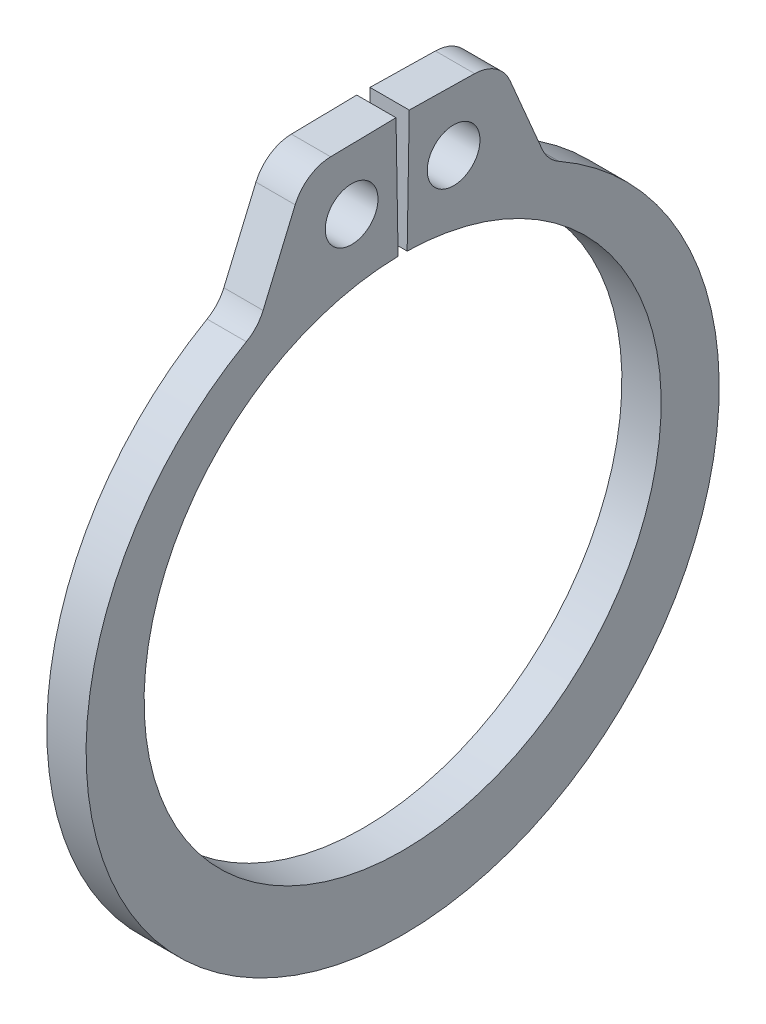
ISO-10303-21;
HEADER;
FILE_DESCRIPTION(('STEP AP214'),'2;1');
FILE_NAME('part.step','',(''),(''),'','','');
FILE_SCHEMA(('AUTOMOTIVE_DESIGN { 1 0 10303 214 1 1 1 1 }'));
ENDSEC;
DATA;
#1=APPLICATION_CONTEXT('core data for automotive mechanical design processes');
#2=APPLICATION_PROTOCOL_DEFINITION('international standard','automotive_design',2000,#1);
#3=PRODUCT_CONTEXT('',#1,'mechanical');
#4=PRODUCT('Part','Part','',(#3));
#5=PRODUCT_RELATED_PRODUCT_CATEGORY('part','',(#4));
#6=PRODUCT_DEFINITION_FORMATION('','',#4);
#7=PRODUCT_DEFINITION_CONTEXT('part definition',#1,'design');
#8=PRODUCT_DEFINITION('design','',#6,#7);
#9=PRODUCT_DEFINITION_SHAPE('','',#8);
#10=(LENGTH_UNIT() NAMED_UNIT(*) SI_UNIT(.MILLI.,.METRE.));
#11=(NAMED_UNIT(*) PLANE_ANGLE_UNIT() SI_UNIT($,.RADIAN.));
#12=(NAMED_UNIT(*) SI_UNIT($,.STERADIAN.) SOLID_ANGLE_UNIT());
#13=UNCERTAINTY_MEASURE_WITH_UNIT(LENGTH_MEASURE(1.E-05),#10,'distance_accuracy_value','');
#14=(GEOMETRIC_REPRESENTATION_CONTEXT(3) GLOBAL_UNCERTAINTY_ASSIGNED_CONTEXT((#13)) GLOBAL_UNIT_ASSIGNED_CONTEXT((#10,
#11,#12)) REPRESENTATION_CONTEXT('',''));
#15=CARTESIAN_POINT('',(0.,0.,0.));
#16=DIRECTION('',(0.,0.,1.));
#17=DIRECTION('',(1.,0.,0.));
#18=AXIS2_PLACEMENT_3D('',#15,#16,#17);
#19=CARTESIAN_POINT('',(0.4445,0.,0.));
#20=DIRECTION('',(1.,0.,0.));
#21=DIRECTION('',(0.,0.,-1.));
#22=AXIS2_PLACEMENT_3D('',#19,#20,#21);
#23=PLANE('',#22);
#24=CARTESIAN_POINT('',(0.4445,7.20724610900659,-1.15465964864512));
#25=DIRECTION('',(-1.,0.,0.));
#26=DIRECTION('',(0.,0.,1.));
#27=AXIS2_PLACEMENT_3D('',#24,#25,#26);
#28=CIRCLE('',#27,0.5969);
#29=CARTESIAN_POINT('',(0.4445,7.20724610900659,-0.557759648645121));
#30=VERTEX_POINT('',#29);
#31=EDGE_CURVE('E108',#30,#30,#28,.T.);
#32=ORIENTED_EDGE('',*,*,#31,.T.);
#33=EDGE_LOOP('',(#32));
#34=FACE_BOUND('',#33,.T.);
#35=CARTESIAN_POINT('',(0.4445,0.,0.));
#36=DIRECTION('',(-1.,0.,0.));
#37=DIRECTION('',(0.,0.,1.));
#38=AXIS2_PLACEMENT_3D('',#35,#36,#37);
#39=CIRCLE('',#38,5.8547);
#40=CARTESIAN_POINT('',(0.4445,5.85380830083212,-0.102178603968365));
#41=VERTEX_POINT('',#40);
#42=CARTESIAN_POINT('',(0.4445,5.85380830083212,0.102178603968364));
#43=VERTEX_POINT('',#42);
#44=EDGE_CURVE('E174',#41,#43,#39,.T.);
#45=ORIENTED_EDGE('',*,*,#44,.T.);
#46=DIRECTION('',(0.,-0.999847695156391,-0.0174524064372836));
#47=VECTOR('',#46,1.);
#48=CARTESIAN_POINT('',(0.4445,5.85380830083212,0.102178603968364));
#49=LINE('',#48,#47);
#50=CARTESIAN_POINT('',(0.4445,8.59659049818514,0.150054045307121));
#51=VERTEX_POINT('',#50);
#52=EDGE_CURVE('E124',#43,#51,#49,.F.);
#53=ORIENTED_EDGE('',*,*,#52,.T.);
#54=DIRECTION('',(0.,0.0174524064372841,-0.999847695156391));
#55=VECTOR('',#54,1.);
#56=CARTESIAN_POINT('',(0.4445,8.59659049818514,0.150054045307121));
#57=LINE('',#56,#55);
#58=CARTESIAN_POINT('',(0.4445,8.57074959100772,1.63047862600547));
#59=VERTEX_POINT('',#58);
#60=EDGE_CURVE('E119',#51,#59,#57,.F.);
#61=ORIENTED_EDGE('',*,*,#60,.T.);
#62=CARTESIAN_POINT('',(0.4445,7.68188499001369,1.61496343668273));
#63=DIRECTION('',(-1.,0.,0.));
#64=DIRECTION('',(0.,0.,1.));
#65=AXIS2_PLACEMENT_3D('',#62,#63,#64);
#66=CIRCLE('',#65,0.889);
#67=CARTESIAN_POINT('',(0.4445,8.02998759243226,2.43297662617873));
#68=VERTEX_POINT('',#67);
#69=EDGE_CURVE('E112',#68,#59,#66,.T.);
#70=ORIENTED_EDGE('',*,*,#69,.F.);
#71=DIRECTION('',(0.,0.920149819455567,-0.391566481910655));
#72=VECTOR('',#71,1.);
#73=CARTESIAN_POINT('',(0.4445,8.56068391718107,2.20714069332188));
#74=LINE('',#73,#72);
#75=CARTESIAN_POINT('',(0.4445,6.32221463110736,3.15971333386378));
#76=VERTEX_POINT('',#75);
#77=EDGE_CURVE('E107',#68,#76,#74,.F.);
#78=ORIENTED_EDGE('',*,*,#77,.T.);
#79=CARTESIAN_POINT('',(0.4445,6.67031723352593,3.97772652335978));
#80=DIRECTION('',(-1.,0.,0.));
#81=DIRECTION('',(0.,0.,1.));
#82=AXIS2_PLACEMENT_3D('',#79,#80,#81);
#83=CIRCLE('',#82,0.889);
#84=CARTESIAN_POINT('',(0.4445,5.89719335877508,3.53886381784672));
#85=VERTEX_POINT('',#84);
#86=EDGE_CURVE('E98',#76,#85,#83,.T.);
#87=ORIENTED_EDGE('',*,*,#86,.T.);
#88=CARTESIAN_POINT('',(0.4445,-0.337057291142251,0.));
#89=DIRECTION('',(-1.,0.,0.));
#90=DIRECTION('',(0.,0.,1.));
#91=AXIS2_PLACEMENT_3D('',#88,#89,#90);
#92=CIRCLE('',#91,7.16864270885775);
#93=CARTESIAN_POINT('',(0.4445,5.89719335877508,-3.53886381784672));
#94=VERTEX_POINT('',#93);
#95=EDGE_CURVE('E181',#94,#85,#92,.T.);
#96=ORIENTED_EDGE('',*,*,#95,.F.);
#97=CARTESIAN_POINT('',(0.4445,6.67031723352593,-3.97772652335978));
#98=DIRECTION('',(-1.,0.,0.));
#99=DIRECTION('',(0.,0.,1.));
#100=AXIS2_PLACEMENT_3D('',#97,#98,#99);
#101=CIRCLE('',#100,0.889);
#102=CARTESIAN_POINT('',(0.4445,6.32221463110736,-3.15971333386378));
#103=VERTEX_POINT('',#102);
#104=EDGE_CURVE('E178',#94,#103,#101,.T.);
#105=ORIENTED_EDGE('',*,*,#104,.T.);
#106=DIRECTION('',(0.,-0.920149819455567,-0.391566481910655));
#107=VECTOR('',#106,1.);
#108=CARTESIAN_POINT('',(0.4445,8.56068391718107,-2.20714069332188));
#109=LINE('',#108,#107);
#110=CARTESIAN_POINT('',(0.4445,8.02998759243226,-2.43297662617873));
#111=VERTEX_POINT('',#110);
#112=EDGE_CURVE('E143',#103,#111,#109,.F.);
#113=ORIENTED_EDGE('',*,*,#112,.T.);
#114=CARTESIAN_POINT('',(0.4445,7.68188499001369,-1.61496343668273));
#115=DIRECTION('',(-1.,0.,0.));
#116=DIRECTION('',(0.,0.,1.));
#117=AXIS2_PLACEMENT_3D('',#114,#115,#116);
#118=CIRCLE('',#117,0.889);
#119=CARTESIAN_POINT('',(0.4445,8.57074959100772,-1.63047862600547));
#120=VERTEX_POINT('',#119);
#121=EDGE_CURVE('E145',#120,#111,#118,.T.);
#122=ORIENTED_EDGE('',*,*,#121,.F.);
#123=DIRECTION('',(0.,-0.0174524064372841,-0.999847695156391));
#124=VECTOR('',#123,1.);
#125=CARTESIAN_POINT('',(0.4445,8.59659049818514,-0.150054045307121));
#126=LINE('',#125,#124);
#127=CARTESIAN_POINT('',(0.4445,8.59659049818514,-0.150054045307121));
#128=VERTEX_POINT('',#127);
#129=EDGE_CURVE('E137',#120,#128,#126,.F.);
#130=ORIENTED_EDGE('',*,*,#129,.T.);
#131=DIRECTION('',(0.,0.999847695156391,-0.0174524064372836));
#132=VECTOR('',#131,1.);
#133=CARTESIAN_POINT('',(0.4445,5.85380830083212,-0.102178603968364));
#134=LINE('',#133,#132);
#135=EDGE_CURVE('E130',#128,#41,#134,.F.);
#136=ORIENTED_EDGE('',*,*,#135,.T.);
#137=EDGE_LOOP('',(#45,#53,#61,#70,#78,#87,#96,#105,#113,#122,#130,#136));
#138=FACE_BOUND('',#137,.T.);
#139=CARTESIAN_POINT('',(0.4445,7.20724610900659,1.15465964864512));
#140=DIRECTION('',(-1.,0.,0.));
#141=DIRECTION('',(0.,0.,1.));
#142=AXIS2_PLACEMENT_3D('',#139,#140,#141);
#143=CIRCLE('',#142,0.5969);
#144=CARTESIAN_POINT('',(0.4445,7.20724610900659,1.75155964864512));
#145=VERTEX_POINT('',#144);
#146=EDGE_CURVE('E20',#145,#145,#143,.T.);
#147=ORIENTED_EDGE('',*,*,#146,.T.);
#148=EDGE_LOOP('',(#147));
#149=FACE_BOUND('',#148,.T.);
#150=ADVANCED_FACE('F17',(#34,#138,#149),#23,.T.);
#151=CARTESIAN_POINT('',(0.4445,7.20724610900659,1.15465964864512));
#152=DIRECTION('',(-1.,0.,0.));
#153=DIRECTION('',(0.,0.,1.));
#154=AXIS2_PLACEMENT_3D('',#151,#152,#153);
#155=CYLINDRICAL_SURFACE('',#154,0.5969);
#156=CARTESIAN_POINT('',(-0.4445,7.20724610900659,1.15465964864512));
#157=DIRECTION('',(-1.,0.,0.));
#158=DIRECTION('',(0.,0.,1.));
#159=AXIS2_PLACEMENT_3D('',#156,#157,#158);
#160=CIRCLE('',#159,0.5969);
#161=CARTESIAN_POINT('',(-0.4445,7.20724610900659,1.75155964864512));
#162=VERTEX_POINT('',#161);
#163=EDGE_CURVE('E168',#162,#162,#160,.T.);
#164=ORIENTED_EDGE('',*,*,#163,.T.);
#165=EDGE_LOOP('',(#164));
#166=FACE_BOUND('',#165,.T.);
#167=ORIENTED_EDGE('',*,*,#146,.F.);
#168=EDGE_LOOP('',(#167));
#169=FACE_BOUND('',#168,.T.);
#170=ADVANCED_FACE('F388',(#166,#169),#155,.F.);
#171=CARTESIAN_POINT('',(0.4445,6.67031723352593,3.97772652335978));
#172=DIRECTION('',(-1.,0.,0.));
#173=DIRECTION('',(0.,0.,1.));
#174=AXIS2_PLACEMENT_3D('',#171,#172,#173);
#175=CYLINDRICAL_SURFACE('',#174,0.889);
#176=DIRECTION('',(1.,0.,0.));
#177=VECTOR('',#176,1.);
#178=CARTESIAN_POINT('',(0.4445,6.32221463110736,3.15971333386378));
#179=LINE('',#178,#177);
#180=CARTESIAN_POINT('',(-0.4445,6.32221463110736,3.15971333386378));
#181=VERTEX_POINT('',#180);
#182=EDGE_CURVE('E102',#76,#181,#179,.F.);
#183=ORIENTED_EDGE('',*,*,#182,.T.);
#184=CARTESIAN_POINT('',(-0.4445,6.67031723352593,3.97772652335978));
#185=DIRECTION('',(-1.,0.,0.));
#186=DIRECTION('',(0.,0.,1.));
#187=AXIS2_PLACEMENT_3D('',#184,#185,#186);
#188=CIRCLE('',#187,0.889);
#189=CARTESIAN_POINT('',(-0.4445,5.89719335877508,3.53886381784672));
#190=VERTEX_POINT('',#189);
#191=EDGE_CURVE('E166',#181,#190,#188,.T.);
#192=ORIENTED_EDGE('',*,*,#191,.T.);
#193=DIRECTION('',(-1.,0.,0.));
#194=VECTOR('',#193,1.);
#195=CARTESIAN_POINT('',(0.4445,5.89719335877508,3.53886381784672));
#196=LINE('',#195,#194);
#197=EDGE_CURVE('E103',#85,#190,#196,.T.);
#198=ORIENTED_EDGE('',*,*,#197,.F.);
#199=ORIENTED_EDGE('',*,*,#86,.F.);
#200=EDGE_LOOP('',(#183,#192,#198,#199));
#201=FACE_BOUND('',#200,.T.);
#202=ADVANCED_FACE('F100',(#201),#175,.F.);
#203=CARTESIAN_POINT('',(0.4445,-0.337057291142251,0.));
#204=DIRECTION('',(-1.,0.,0.));
#205=DIRECTION('',(0.,0.,1.));
#206=AXIS2_PLACEMENT_3D('',#203,#204,#205);
#207=CYLINDRICAL_SURFACE('',#206,7.16864270885775);
#208=CARTESIAN_POINT('',(-0.4445,-0.337057291142251,0.));
#209=DIRECTION('',(-1.,0.,0.));
#210=DIRECTION('',(0.,0.,1.));
#211=AXIS2_PLACEMENT_3D('',#208,#209,#210);
#212=CIRCLE('',#211,7.16864270885775);
#213=CARTESIAN_POINT('',(-0.4445,5.89719335877508,-3.53886381784672));
#214=VERTEX_POINT('',#213);
#215=EDGE_CURVE('E164',#190,#214,#212,.F.);
#216=ORIENTED_EDGE('',*,*,#215,.T.);
#217=DIRECTION('',(-1.,0.,0.));
#218=VECTOR('',#217,1.);
#219=CARTESIAN_POINT('',(0.4445,5.89719335877508,-3.53886381784672));
#220=LINE('',#219,#218);
#221=EDGE_CURVE('E180',#214,#94,#220,.F.);
#222=ORIENTED_EDGE('',*,*,#221,.T.);
#223=ORIENTED_EDGE('',*,*,#95,.T.);
#224=ORIENTED_EDGE('',*,*,#197,.T.);
#225=EDGE_LOOP('',(#216,#222,#223,#224));
#226=FACE_BOUND('',#225,.T.);
#227=ADVANCED_FACE('F186',(#226),#207,.T.);
#228=CARTESIAN_POINT('',(0.4445,6.67031723352593,-3.97772652335978));
#229=DIRECTION('',(-1.,0.,0.));
#230=DIRECTION('',(0.,0.,1.));
#231=AXIS2_PLACEMENT_3D('',#228,#229,#230);
#232=CYLINDRICAL_SURFACE('',#231,0.889);
#233=ORIENTED_EDGE('',*,*,#221,.F.);
#234=CARTESIAN_POINT('',(-0.4445,6.67031723352593,-3.97772652335978));
#235=DIRECTION('',(-1.,0.,0.));
#236=DIRECTION('',(0.,0.,1.));
#237=AXIS2_PLACEMENT_3D('',#234,#235,#236);
#238=CIRCLE('',#237,0.889);
#239=CARTESIAN_POINT('',(-0.4445,6.32221463110736,-3.15971333386378));
#240=VERTEX_POINT('',#239);
#241=EDGE_CURVE('E161',#214,#240,#238,.T.);
#242=ORIENTED_EDGE('',*,*,#241,.T.);
#243=DIRECTION('',(1.,0.,0.));
#244=VECTOR('',#243,1.);
#245=CARTESIAN_POINT('',(0.4445,6.32221463110736,-3.15971333386378));
#246=LINE('',#245,#244);
#247=EDGE_CURVE('E146',#240,#103,#246,.T.);
#248=ORIENTED_EDGE('',*,*,#247,.T.);
#249=ORIENTED_EDGE('',*,*,#104,.F.);
#250=EDGE_LOOP('',(#233,#242,#248,#249));
#251=FACE_BOUND('',#250,.T.);
#252=ADVANCED_FACE('F198',(#251),#232,.F.);
#253=CARTESIAN_POINT('',(0.4445,8.56068391718107,-2.20714069332188));
#254=DIRECTION('',(0.,-0.391566481910655,0.920149819455567));
#255=DIRECTION('',(0.,-0.920149819455567,-0.391566481910655));
#256=AXIS2_PLACEMENT_3D('',#253,#254,#255);
#257=PLANE('',#256);
#258=ORIENTED_EDGE('',*,*,#247,.F.);
#259=DIRECTION('',(0.,0.920149819455567,0.391566481910655));
#260=VECTOR('',#259,1.);
#261=CARTESIAN_POINT('',(-0.4445,6.32221463110736,-3.15971333386378));
#262=LINE('',#261,#260);
#263=CARTESIAN_POINT('',(-0.4445,8.02998759243226,-2.43297662617873));
#264=VERTEX_POINT('',#263);
#265=EDGE_CURVE('E160',#240,#264,#262,.T.);
#266=ORIENTED_EDGE('',*,*,#265,.T.);
#267=DIRECTION('',(-1.,0.,0.));
#268=VECTOR('',#267,1.);
#269=CARTESIAN_POINT('',(0.4445,8.02998759243226,-2.43297662617873));
#270=LINE('',#269,#268);
#271=EDGE_CURVE('E177',#111,#264,#270,.T.);
#272=ORIENTED_EDGE('',*,*,#271,.F.);
#273=ORIENTED_EDGE('',*,*,#112,.F.);
#274=EDGE_LOOP('',(#258,#266,#272,#273));
#275=FACE_BOUND('',#274,.T.);
#276=ADVANCED_FACE('F203',(#275),#257,.F.);
#277=CARTESIAN_POINT('',(0.4445,7.68188499001369,-1.61496343668273));
#278=DIRECTION('',(-1.,0.,0.));
#279=DIRECTION('',(0.,0.,1.));
#280=AXIS2_PLACEMENT_3D('',#277,#278,#279);
#281=CYLINDRICAL_SURFACE('',#280,0.889);
#282=CARTESIAN_POINT('',(-0.4445,7.68188499001369,-1.61496343668273));
#283=DIRECTION('',(-1.,0.,0.));
#284=DIRECTION('',(0.,0.,1.));
#285=AXIS2_PLACEMENT_3D('',#282,#283,#284);
#286=CIRCLE('',#285,0.889);
#287=CARTESIAN_POINT('',(-0.4445,8.57074959100772,-1.63047862600547));
#288=VERTEX_POINT('',#287);
#289=EDGE_CURVE('E156',#264,#288,#286,.F.);
#290=ORIENTED_EDGE('',*,*,#289,.T.);
#291=DIRECTION('',(1.,0.,0.));
#292=VECTOR('',#291,1.);
#293=CARTESIAN_POINT('',(0.4445,8.57074959100772,-1.63047862600547));
#294=LINE('',#293,#292);
#295=EDGE_CURVE('E140',#288,#120,#294,.T.);
#296=ORIENTED_EDGE('',*,*,#295,.T.);
#297=ORIENTED_EDGE('',*,*,#121,.T.);
#298=ORIENTED_EDGE('',*,*,#271,.T.);
#299=EDGE_LOOP('',(#290,#296,#297,#298));
#300=FACE_BOUND('',#299,.T.);
#301=ADVANCED_FACE('F266',(#300),#281,.T.);
#302=CARTESIAN_POINT('',(0.4445,8.59659049818514,-0.150054045307121));
#303=DIRECTION('',(0.,-0.999847695156391,0.0174524064372841));
#304=DIRECTION('',(0.,-0.0174524064372841,-0.999847695156391));
#305=AXIS2_PLACEMENT_3D('',#302,#303,#304);
#306=PLANE('',#305);
#307=ORIENTED_EDGE('',*,*,#295,.F.);
#308=DIRECTION('',(0.,0.0174524064372836,0.999847695156391));
#309=VECTOR('',#308,1.);
#310=CARTESIAN_POINT('',(-0.4445,8.57074959100772,-1.63047862600547));
#311=LINE('',#310,#309);
#312=CARTESIAN_POINT('',(-0.4445,8.59659049818514,-0.150054045307121));
#313=VERTEX_POINT('',#312);
#314=EDGE_CURVE('E159',#288,#313,#311,.T.);
#315=ORIENTED_EDGE('',*,*,#314,.T.);
#316=DIRECTION('',(1.,0.,0.));
#317=VECTOR('',#316,1.);
#318=CARTESIAN_POINT('',(0.4445,8.59659049818514,-0.150054045307121));
#319=LINE('',#318,#317);
#320=EDGE_CURVE('E134',#313,#128,#319,.T.);
#321=ORIENTED_EDGE('',*,*,#320,.T.);
#322=ORIENTED_EDGE('',*,*,#129,.F.);
#323=EDGE_LOOP('',(#307,#315,#321,#322));
#324=FACE_BOUND('',#323,.T.);
#325=ADVANCED_FACE('F264',(#324),#306,.F.);
#326=CARTESIAN_POINT('',(0.4445,5.85380830083212,-0.102178603968364));
#327=DIRECTION('',(0.,-0.0174524064372836,-0.999847695156391));
#328=DIRECTION('',(0.,0.999847695156391,-0.0174524064372836));
#329=AXIS2_PLACEMENT_3D('',#326,#327,#328);
#330=PLANE('',#329);
#331=DIRECTION('',(-1.,0.,0.));
#332=VECTOR('',#331,1.);
#333=CARTESIAN_POINT('',(0.4445,5.85380830083212,-0.102178603968365));
#334=LINE('',#333,#332);
#335=CARTESIAN_POINT('',(-0.4445,5.85380830083212,-0.102178603968365));
#336=VERTEX_POINT('',#335);
#337=EDGE_CURVE('E133',#336,#41,#334,.F.);
#338=ORIENTED_EDGE('',*,*,#337,.T.);
#339=ORIENTED_EDGE('',*,*,#135,.F.);
#340=ORIENTED_EDGE('',*,*,#320,.F.);
#341=DIRECTION('',(0.,-0.999847695156391,0.0174524064372836));
#342=VECTOR('',#341,1.);
#343=CARTESIAN_POINT('',(-0.4445,8.59659049818514,-0.150054045307121));
#344=LINE('',#343,#342);
#345=EDGE_CURVE('E155',#313,#336,#344,.T.);
#346=ORIENTED_EDGE('',*,*,#345,.T.);
#347=EDGE_LOOP('',(#338,#339,#340,#346));
#348=FACE_BOUND('',#347,.T.);
#349=ADVANCED_FACE('F259',(#348),#330,.F.);
#350=CARTESIAN_POINT('',(0.4445,0.,0.));
#351=DIRECTION('',(-1.,0.,0.));
#352=DIRECTION('',(0.,0.,1.));
#353=AXIS2_PLACEMENT_3D('',#350,#351,#352);
#354=CYLINDRICAL_SURFACE('',#353,5.8547);
#355=ORIENTED_EDGE('',*,*,#44,.F.);
#356=ORIENTED_EDGE('',*,*,#337,.F.);
#357=CARTESIAN_POINT('',(-0.4445,0.,0.));
#358=DIRECTION('',(-1.,0.,0.));
#359=DIRECTION('',(0.,0.,1.));
#360=AXIS2_PLACEMENT_3D('',#357,#358,#359);
#361=CIRCLE('',#360,5.8547);
#362=CARTESIAN_POINT('',(-0.4445,5.85380830083212,0.102178603968364));
#363=VERTEX_POINT('',#362);
#364=EDGE_CURVE('E152',#336,#363,#361,.T.);
#365=ORIENTED_EDGE('',*,*,#364,.T.);
#366=DIRECTION('',(1.,0.,0.));
#367=VECTOR('',#366,1.);
#368=CARTESIAN_POINT('',(0.4445,5.85380830083212,0.102178603968364));
#369=LINE('',#368,#367);
#370=EDGE_CURVE('E127',#363,#43,#369,.T.);
#371=ORIENTED_EDGE('',*,*,#370,.T.);
#372=EDGE_LOOP('',(#355,#356,#365,#371));
#373=FACE_BOUND('',#372,.T.);
#374=ADVANCED_FACE('F254',(#373),#354,.F.);
#375=CARTESIAN_POINT('',(0.4445,5.85380830083212,0.102178603968364));
#376=DIRECTION('',(0.,-0.0174524064372836,0.999847695156391));
#377=DIRECTION('',(0.,-0.999847695156391,-0.0174524064372836));
#378=AXIS2_PLACEMENT_3D('',#375,#376,#377);
#379=PLANE('',#378);
#380=DIRECTION('',(1.,0.,0.));
#381=VECTOR('',#380,1.);
#382=CARTESIAN_POINT('',(0.4445,8.59659049818514,0.150054045307121));
#383=LINE('',#382,#381);
#384=CARTESIAN_POINT('',(-0.4445,8.59659049818514,0.150054045307121));
#385=VERTEX_POINT('',#384);
#386=EDGE_CURVE('E121',#385,#51,#383,.T.);
#387=ORIENTED_EDGE('',*,*,#386,.T.);
#388=ORIENTED_EDGE('',*,*,#52,.F.);
#389=ORIENTED_EDGE('',*,*,#370,.F.);
#390=DIRECTION('',(0.,0.999847695156391,0.0174524064372836));
#391=VECTOR('',#390,1.);
#392=CARTESIAN_POINT('',(-0.4445,5.85380830083212,0.102178603968364));
#393=LINE('',#392,#391);
#394=EDGE_CURVE('E154',#363,#385,#393,.T.);
#395=ORIENTED_EDGE('',*,*,#394,.T.);
#396=EDGE_LOOP('',(#387,#388,#389,#395));
#397=FACE_BOUND('',#396,.T.);
#398=ADVANCED_FACE('F251',(#397),#379,.F.);
#399=CARTESIAN_POINT('',(0.4445,8.59659049818514,0.150054045307121));
#400=DIRECTION('',(0.,-0.999847695156391,-0.0174524064372841));
#401=DIRECTION('',(0.,0.0174524064372841,-0.999847695156391));
#402=AXIS2_PLACEMENT_3D('',#399,#400,#401);
#403=PLANE('',#402);
#404=DIRECTION('',(-1.,0.,0.));
#405=VECTOR('',#404,1.);
#406=CARTESIAN_POINT('',(0.4445,8.57074959100772,1.63047862600547));
#407=LINE('',#406,#405);
#408=CARTESIAN_POINT('',(-0.4445,8.57074959100772,1.63047862600547));
#409=VERTEX_POINT('',#408);
#410=EDGE_CURVE('E114',#59,#409,#407,.T.);
#411=ORIENTED_EDGE('',*,*,#410,.F.);
#412=ORIENTED_EDGE('',*,*,#60,.F.);
#413=ORIENTED_EDGE('',*,*,#386,.F.);
#414=DIRECTION('',(0.,-0.0174524064372836,0.999847695156391));
#415=VECTOR('',#414,1.);
#416=CARTESIAN_POINT('',(-0.4445,8.59659049818514,0.150054045307121));
#417=LINE('',#416,#415);
#418=EDGE_CURVE('E151',#385,#409,#417,.T.);
#419=ORIENTED_EDGE('',*,*,#418,.T.);
#420=EDGE_LOOP('',(#411,#412,#413,#419));
#421=FACE_BOUND('',#420,.T.);
#422=ADVANCED_FACE('F244',(#421),#403,.F.);
#423=CARTESIAN_POINT('',(0.4445,7.68188499001369,1.61496343668273));
#424=DIRECTION('',(-1.,0.,0.));
#425=DIRECTION('',(0.,0.,1.));
#426=AXIS2_PLACEMENT_3D('',#423,#424,#425);
#427=CYLINDRICAL_SURFACE('',#426,0.889);
#428=CARTESIAN_POINT('',(-0.4445,7.68188499001369,1.61496343668273));
#429=DIRECTION('',(-1.,0.,0.));
#430=DIRECTION('',(0.,0.,1.));
#431=AXIS2_PLACEMENT_3D('',#428,#429,#430);
#432=CIRCLE('',#431,0.889);
#433=CARTESIAN_POINT('',(-0.4445,8.02998759243226,2.43297662617873));
#434=VERTEX_POINT('',#433);
#435=EDGE_CURVE('E148',#409,#434,#432,.F.);
#436=ORIENTED_EDGE('',*,*,#435,.T.);
#437=DIRECTION('',(1.,0.,0.));
#438=VECTOR('',#437,1.);
#439=CARTESIAN_POINT('',(0.4445,8.02998759243226,2.43297662617873));
#440=LINE('',#439,#438);
#441=EDGE_CURVE('E35',#434,#68,#440,.T.);
#442=ORIENTED_EDGE('',*,*,#441,.T.);
#443=ORIENTED_EDGE('',*,*,#69,.T.);
#444=ORIENTED_EDGE('',*,*,#410,.T.);
#445=EDGE_LOOP('',(#436,#442,#443,#444));
#446=FACE_BOUND('',#445,.T.);
#447=ADVANCED_FACE('F289',(#446),#427,.T.);
#448=CARTESIAN_POINT('',(0.4445,8.56068391718107,2.20714069332188));
#449=DIRECTION('',(0.,-0.391566481910655,-0.920149819455567));
#450=DIRECTION('',(0.,0.920149819455567,-0.391566481910655));
#451=AXIS2_PLACEMENT_3D('',#448,#449,#450);
#452=PLANE('',#451);
#453=ORIENTED_EDGE('',*,*,#182,.F.);
#454=ORIENTED_EDGE('',*,*,#77,.F.);
#455=ORIENTED_EDGE('',*,*,#441,.F.);
#456=DIRECTION('',(0.,-0.920149819455567,0.391566481910655));
#457=VECTOR('',#456,1.);
#458=CARTESIAN_POINT('',(-0.4445,8.02998759243226,2.43297662617873));
#459=LINE('',#458,#457);
#460=EDGE_CURVE('E26',#434,#181,#459,.T.);
#461=ORIENTED_EDGE('',*,*,#460,.T.);
#462=EDGE_LOOP('',(#453,#454,#455,#461));
#463=FACE_BOUND('',#462,.T.);
#464=ADVANCED_FACE('F106',(#463),#452,.F.);
#465=CARTESIAN_POINT('',(0.4445,7.20724610900659,-1.15465964864512));
#466=DIRECTION('',(-1.,0.,0.));
#467=DIRECTION('',(0.,0.,1.));
#468=AXIS2_PLACEMENT_3D('',#465,#466,#467);
#469=CYLINDRICAL_SURFACE('',#468,0.5969);
#470=CARTESIAN_POINT('',(-0.4445,7.20724610900659,-1.15465964864512));
#471=DIRECTION('',(-1.,0.,0.));
#472=DIRECTION('',(0.,0.,1.));
#473=AXIS2_PLACEMENT_3D('',#470,#471,#472);
#474=CIRCLE('',#473,0.5969);
#475=CARTESIAN_POINT('',(-0.4445,7.20724610900659,-0.557759648645121));
#476=VERTEX_POINT('',#475);
#477=EDGE_CURVE('E11',#476,#476,#474,.T.);
#478=ORIENTED_EDGE('',*,*,#477,.T.);
#479=EDGE_LOOP('',(#478));
#480=FACE_BOUND('',#479,.T.);
#481=ORIENTED_EDGE('',*,*,#31,.F.);
#482=EDGE_LOOP('',(#481));
#483=FACE_BOUND('',#482,.T.);
#484=ADVANCED_FACE('F277',(#480,#483),#469,.F.);
#485=CARTESIAN_POINT('',(-0.4445,0.,0.));
#486=DIRECTION('',(1.,0.,0.));
#487=DIRECTION('',(0.,0.,-1.));
#488=AXIS2_PLACEMENT_3D('',#485,#486,#487);
#489=PLANE('',#488);
#490=ORIENTED_EDGE('',*,*,#477,.F.);
#491=EDGE_LOOP('',(#490));
#492=FACE_BOUND('',#491,.T.);
#493=ORIENTED_EDGE('',*,*,#435,.F.);
#494=ORIENTED_EDGE('',*,*,#418,.F.);
#495=ORIENTED_EDGE('',*,*,#394,.F.);
#496=ORIENTED_EDGE('',*,*,#364,.F.);
#497=ORIENTED_EDGE('',*,*,#345,.F.);
#498=ORIENTED_EDGE('',*,*,#314,.F.);
#499=ORIENTED_EDGE('',*,*,#289,.F.);
#500=ORIENTED_EDGE('',*,*,#265,.F.);
#501=ORIENTED_EDGE('',*,*,#241,.F.);
#502=ORIENTED_EDGE('',*,*,#215,.F.);
#503=ORIENTED_EDGE('',*,*,#191,.F.);
#504=ORIENTED_EDGE('',*,*,#460,.F.);
#505=EDGE_LOOP('',(#493,#494,#495,#496,#497,#498,#499,#500,#501,#502,#503,#504));
#506=FACE_BOUND('',#505,.T.);
#507=ORIENTED_EDGE('',*,*,#163,.F.);
#508=EDGE_LOOP('',(#507));
#509=FACE_BOUND('',#508,.T.);
#510=ADVANCED_FACE('F191',(#492,#506,#509),#489,.F.);
#511=CLOSED_SHELL('',(#150,#170,#202,#227,#252,#276,#301,#325,#349,#374,#398,#422,#447,#464,
#484,#510));
#512=MANIFOLD_SOLID_BREP('B1',#511);
#513=ADVANCED_BREP_SHAPE_REPRESENTATION('',(#18,#512),#14);
#514=SHAPE_DEFINITION_REPRESENTATION(#9,#513);
ENDSEC;
END-ISO-10303-21;
